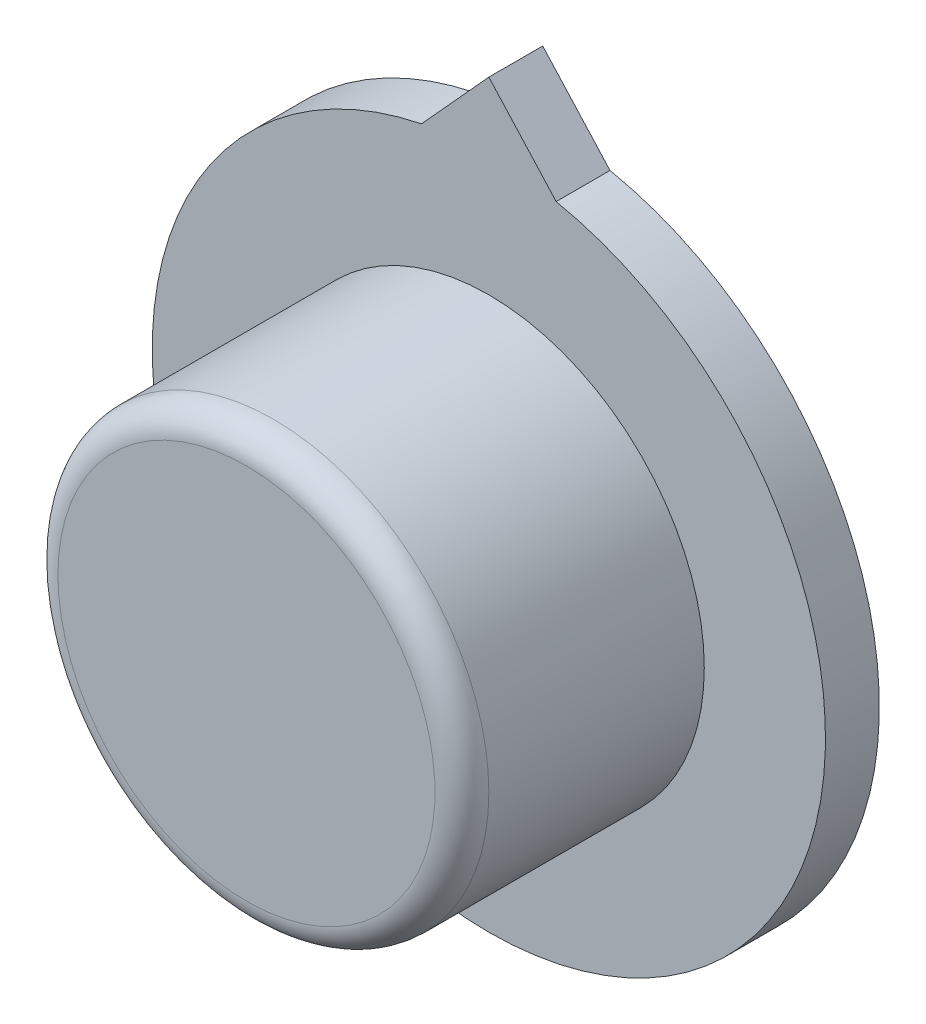
ISO-10303-21;
HEADER;
FILE_DESCRIPTION(('STEP AP214'),'2;1');
FILE_NAME('part.step','',(''),(''),'','','');
FILE_SCHEMA(('AUTOMOTIVE_DESIGN { 1 0 10303 214 1 1 1 1 }'));
ENDSEC;
DATA;
#1=APPLICATION_CONTEXT('core data for automotive mechanical design processes');
#2=APPLICATION_PROTOCOL_DEFINITION('international standard','automotive_design',2000,#1);
#3=PRODUCT_CONTEXT('',#1,'mechanical');
#4=PRODUCT('Part','Part','',(#3));
#5=PRODUCT_RELATED_PRODUCT_CATEGORY('part','',(#4));
#6=PRODUCT_DEFINITION_FORMATION('','',#4);
#7=PRODUCT_DEFINITION_CONTEXT('part definition',#1,'design');
#8=PRODUCT_DEFINITION('design','',#6,#7);
#9=PRODUCT_DEFINITION_SHAPE('','',#8);
#10=(LENGTH_UNIT() NAMED_UNIT(*) SI_UNIT(.MILLI.,.METRE.));
#11=(NAMED_UNIT(*) PLANE_ANGLE_UNIT() SI_UNIT($,.RADIAN.));
#12=(NAMED_UNIT(*) SI_UNIT($,.STERADIAN.) SOLID_ANGLE_UNIT());
#13=UNCERTAINTY_MEASURE_WITH_UNIT(LENGTH_MEASURE(1.E-05),#10,'distance_accuracy_value','');
#14=(GEOMETRIC_REPRESENTATION_CONTEXT(3) GLOBAL_UNCERTAINTY_ASSIGNED_CONTEXT((#13)) GLOBAL_UNIT_ASSIGNED_CONTEXT((#10,
#11,#12)) REPRESENTATION_CONTEXT('',''));
#15=CARTESIAN_POINT('',(0.,0.,0.));
#16=DIRECTION('',(0.,0.,1.));
#17=DIRECTION('',(1.,0.,0.));
#18=AXIS2_PLACEMENT_3D('',#15,#16,#17);
#19=CARTESIAN_POINT('',(0.,0.,-3.97770916903478));
#20=DIRECTION('',(0.,0.,-1.));
#21=DIRECTION('',(-1.,0.,0.));
#22=AXIS2_PLACEMENT_3D('',#19,#20,#21);
#23=PLANE('',#22);
#24=CARTESIAN_POINT('',(0.,0.,-3.97770916903478));
#25=DIRECTION('',(0.,0.,-1.));
#26=DIRECTION('',(-1.,0.,0.));
#27=AXIS2_PLACEMENT_3D('',#24,#25,#26);
#28=CIRCLE('',#27,2.);
#29=CARTESIAN_POINT('',(-2.,0.,-3.97770916903478));
#30=VERTEX_POINT('',#29);
#31=EDGE_CURVE('E21',#30,#30,#28,.F.);
#32=ORIENTED_EDGE('',*,*,#31,.F.);
#33=EDGE_LOOP('',(#32));
#34=FACE_BOUND('',#33,.T.);
#35=ADVANCED_FACE('F17',(#34),#23,.T.);
#36=CARTESIAN_POINT('',(0.,7.,0.));
#37=DIRECTION('',(0.,0.,1.));
#38=DIRECTION('',(1.,0.,0.));
#39=AXIS2_PLACEMENT_3D('',#36,#37,#38);
#40=PLANE('',#39);
#41=CARTESIAN_POINT('',(0.,0.,0.));
#42=DIRECTION('',(0.,0.,-1.));
#43=DIRECTION('',(-1.,0.,0.));
#44=AXIS2_PLACEMENT_3D('',#41,#42,#43);
#45=CIRCLE('',#44,7.);
#46=CARTESIAN_POINT('',(-7.,0.,0.));
#47=VERTEX_POINT('',#46);
#48=EDGE_CURVE('E88',#47,#47,#45,.T.);
#49=ORIENTED_EDGE('',*,*,#48,.F.);
#50=EDGE_LOOP('',(#49));
#51=FACE_BOUND('',#50,.T.);
#52=ADVANCED_FACE('F107',(#51),#40,.T.);
#53=CARTESIAN_POINT('',(0.,0.,-2.98885458451739));
#54=DIRECTION('',(0.,0.,-1.));
#55=DIRECTION('',(-1.,0.,0.));
#56=AXIS2_PLACEMENT_3D('',#53,#54,#55);
#57=CYLINDRICAL_SURFACE('',#56,2.);
#58=ORIENTED_EDGE('',*,*,#31,.T.);
#59=EDGE_LOOP('',(#58));
#60=FACE_BOUND('',#59,.T.);
#61=CARTESIAN_POINT('',(0.,0.,-2.));
#62=DIRECTION('',(0.,0.,-1.));
#63=DIRECTION('',(-1.,0.,0.));
#64=AXIS2_PLACEMENT_3D('',#61,#62,#63);
#65=CIRCLE('',#64,2.);
#66=CARTESIAN_POINT('',(-2.,0.,-2.));
#67=VERTEX_POINT('',#66);
#68=EDGE_CURVE('E87',#67,#67,#65,.F.);
#69=ORIENTED_EDGE('',*,*,#68,.F.);
#70=EDGE_LOOP('',(#69));
#71=FACE_BOUND('',#70,.T.);
#72=ADVANCED_FACE('F104',(#60,#71),#57,.T.);
#73=CARTESIAN_POINT('',(0.,0.,-1.));
#74=DIRECTION('',(0.,0.,-1.));
#75=DIRECTION('',(-1.,0.,0.));
#76=AXIS2_PLACEMENT_3D('',#73,#74,#75);
#77=TOROIDAL_SURFACE('',#76,7.,1.);
#78=CARTESIAN_POINT('',(0.,0.,-1.));
#79=DIRECTION('',(0.,0.,-1.));
#80=DIRECTION('',(-1.,0.,0.));
#81=AXIS2_PLACEMENT_3D('',#78,#79,#80);
#82=CIRCLE('',#81,8.);
#83=CARTESIAN_POINT('',(-8.,0.,-1.));
#84=VERTEX_POINT('',#83);
#85=EDGE_CURVE('E83',#84,#84,#82,.T.);
#86=ORIENTED_EDGE('',*,*,#85,.F.);
#87=EDGE_LOOP('',(#86));
#88=FACE_BOUND('',#87,.T.);
#89=ORIENTED_EDGE('',*,*,#48,.T.);
#90=EDGE_LOOP('',(#89));
#91=FACE_BOUND('',#90,.T.);
#92=ADVANCED_FACE('F106',(#88,#91),#77,.T.);
#93=CARTESIAN_POINT('',(0.,2.,-2.));
#94=DIRECTION('',(0.,0.,-1.));
#95=DIRECTION('',(-1.,0.,0.));
#96=AXIS2_PLACEMENT_3D('',#93,#94,#95);
#97=PLANE('',#96);
#98=CARTESIAN_POINT('',(0.,0.,-2.));
#99=DIRECTION('',(0.,0.,-1.));
#100=DIRECTION('',(-1.,0.,0.));
#101=AXIS2_PLACEMENT_3D('',#98,#99,#100);
#102=CIRCLE('',#101,5.5);
#103=CARTESIAN_POINT('',(-5.5,0.,-2.));
#104=VERTEX_POINT('',#103);
#105=EDGE_CURVE('E86',#104,#104,#102,.T.);
#106=ORIENTED_EDGE('',*,*,#105,.T.);
#107=EDGE_LOOP('',(#106));
#108=FACE_BOUND('',#107,.T.);
#109=ORIENTED_EDGE('',*,*,#68,.T.);
#110=EDGE_LOOP('',(#109));
#111=FACE_BOUND('',#110,.T.);
#112=ADVANCED_FACE('F102',(#108,#111),#97,.T.);
#113=CARTESIAN_POINT('',(0.,0.,-5.));
#114=DIRECTION('',(0.,0.,-1.));
#115=DIRECTION('',(-1.,0.,0.));
#116=AXIS2_PLACEMENT_3D('',#113,#114,#115);
#117=CYLINDRICAL_SURFACE('',#116,8.);
#118=CARTESIAN_POINT('',(0.,0.,-9.));
#119=DIRECTION('',(0.,0.,-1.));
#120=DIRECTION('',(-1.,0.,0.));
#121=AXIS2_PLACEMENT_3D('',#118,#119,#120);
#122=CIRCLE('',#121,8.);
#123=CARTESIAN_POINT('',(-8.,0.,-9.));
#124=VERTEX_POINT('',#123);
#125=EDGE_CURVE('E82',#124,#124,#122,.T.);
#126=ORIENTED_EDGE('',*,*,#125,.F.);
#127=EDGE_LOOP('',(#126));
#128=FACE_BOUND('',#127,.T.);
#129=ORIENTED_EDGE('',*,*,#85,.T.);
#130=EDGE_LOOP('',(#129));
#131=FACE_BOUND('',#130,.T.);
#132=ADVANCED_FACE('F142',(#128,#131),#117,.T.);
#133=CARTESIAN_POINT('',(0.,0.,-2.5));
#134=DIRECTION('',(0.,0.,-1.));
#135=DIRECTION('',(-1.,0.,0.));
#136=AXIS2_PLACEMENT_3D('',#133,#134,#135);
#137=TOROIDAL_SURFACE('',#136,5.5,0.500000000000001);
#138=ORIENTED_EDGE('',*,*,#105,.F.);
#139=EDGE_LOOP('',(#138));
#140=FACE_BOUND('',#139,.T.);
#141=CARTESIAN_POINT('',(0.,0.,-2.5));
#142=DIRECTION('',(0.,0.,-1.));
#143=DIRECTION('',(-1.,0.,0.));
#144=AXIS2_PLACEMENT_3D('',#141,#142,#143);
#145=CIRCLE('',#144,6.);
#146=CARTESIAN_POINT('',(-6.,0.,-2.5));
#147=VERTEX_POINT('',#146);
#148=EDGE_CURVE('E65',#147,#147,#145,.T.);
#149=ORIENTED_EDGE('',*,*,#148,.T.);
#150=EDGE_LOOP('',(#149));
#151=FACE_BOUND('',#150,.T.);
#152=ADVANCED_FACE('F19',(#140,#151),#137,.F.);
#153=CARTESIAN_POINT('',(0.,12.5,-9.));
#154=DIRECTION('',(0.,0.,1.));
#155=DIRECTION('',(1.,0.,0.));
#156=AXIS2_PLACEMENT_3D('',#153,#154,#155);
#157=PLANE('',#156);
#158=CARTESIAN_POINT('',(0.,0.,-9.));
#159=DIRECTION('',(0.,0.,-1.));
#160=DIRECTION('',(-1.,0.,0.));
#161=AXIS2_PLACEMENT_3D('',#158,#159,#160);
#162=CIRCLE('',#161,12.5);
#163=CARTESIAN_POINT('',(2.50000000000001,12.2474487139159,-9.));
#164=VERTEX_POINT('',#163);
#165=CARTESIAN_POINT('',(-2.5,12.2474487139159,-9.));
#166=VERTEX_POINT('',#165);
#167=EDGE_CURVE('E53',#164,#166,#162,.T.);
#168=ORIENTED_EDGE('',*,*,#167,.F.);
#169=DIRECTION('',(-0.672331212813863,0.740250457802115,0.));
#170=VECTOR('',#169,1.);
#171=CARTESIAN_POINT('',(2.5,12.2474487139159,-9.));
#172=LINE('',#171,#170);
#173=CARTESIAN_POINT('',(0.,15.,-9.));
#174=VERTEX_POINT('',#173);
#175=EDGE_CURVE('E54',#174,#164,#172,.F.);
#176=ORIENTED_EDGE('',*,*,#175,.F.);
#177=DIRECTION('',(-0.672331212813863,-0.740250457802115,0.));
#178=VECTOR('',#177,1.);
#179=CARTESIAN_POINT('',(0.,15.,-9.));
#180=LINE('',#179,#178);
#181=EDGE_CURVE('E49',#166,#174,#180,.F.);
#182=ORIENTED_EDGE('',*,*,#181,.F.);
#183=EDGE_LOOP('',(#168,#176,#182));
#184=FACE_BOUND('',#183,.T.);
#185=ORIENTED_EDGE('',*,*,#125,.T.);
#186=EDGE_LOOP('',(#185));
#187=FACE_BOUND('',#186,.T.);
#188=ADVANCED_FACE('F55',(#184,#187),#157,.T.);
#189=CARTESIAN_POINT('',(0.,0.,-6.75));
#190=DIRECTION('',(0.,0.,-1.));
#191=DIRECTION('',(-1.,0.,0.));
#192=AXIS2_PLACEMENT_3D('',#189,#190,#191);
#193=CYLINDRICAL_SURFACE('',#192,6.);
#194=ORIENTED_EDGE('',*,*,#148,.F.);
#195=EDGE_LOOP('',(#194));
#196=FACE_BOUND('',#195,.T.);
#197=CARTESIAN_POINT('',(0.,0.,-11.));
#198=DIRECTION('',(0.,0.,-1.));
#199=DIRECTION('',(-1.,0.,0.));
#200=AXIS2_PLACEMENT_3D('',#197,#198,#199);
#201=CIRCLE('',#200,6.);
#202=CARTESIAN_POINT('',(-6.,0.,-11.));
#203=VERTEX_POINT('',#202);
#204=EDGE_CURVE('E91',#203,#203,#201,.F.);
#205=ORIENTED_EDGE('',*,*,#204,.F.);
#206=EDGE_LOOP('',(#205));
#207=FACE_BOUND('',#206,.T.);
#208=ADVANCED_FACE('F136',(#196,#207),#193,.F.);
#209=CARTESIAN_POINT('',(0.,15.,-11.));
#210=DIRECTION('',(-0.740250457802115,0.672331212813863,0.));
#211=DIRECTION('',(-0.672331212813863,-0.740250457802115,0.));
#212=AXIS2_PLACEMENT_3D('',#209,#210,#211);
#213=PLANE('',#212);
#214=DIRECTION('',(0.672331212813863,0.740250457802114,0.));
#215=VECTOR('',#214,1.);
#216=CARTESIAN_POINT('',(-2.5,12.2474487139159,-11.));
#217=LINE('',#216,#215);
#218=CARTESIAN_POINT('',(-2.5,12.2474487139159,-11.));
#219=VERTEX_POINT('',#218);
#220=CARTESIAN_POINT('',(0.,15.,-11.));
#221=VERTEX_POINT('',#220);
#222=EDGE_CURVE('E94',#219,#221,#217,.T.);
#223=ORIENTED_EDGE('',*,*,#222,.F.);
#224=DIRECTION('',(0.,0.,-1.));
#225=VECTOR('',#224,1.);
#226=CARTESIAN_POINT('',(-2.5,12.2474487139159,-10.));
#227=LINE('',#226,#225);
#228=EDGE_CURVE('E64',#166,#219,#227,.T.);
#229=ORIENTED_EDGE('',*,*,#228,.F.);
#230=ORIENTED_EDGE('',*,*,#181,.T.);
#231=DIRECTION('',(0.,0.,1.));
#232=VECTOR('',#231,1.);
#233=CARTESIAN_POINT('',(0.,15.,-11.));
#234=LINE('',#233,#232);
#235=EDGE_CURVE('E58',#221,#174,#234,.T.);
#236=ORIENTED_EDGE('',*,*,#235,.F.);
#237=EDGE_LOOP('',(#223,#229,#230,#236));
#238=FACE_BOUND('',#237,.T.);
#239=ADVANCED_FACE('F62',(#238),#213,.T.);
#240=CARTESIAN_POINT('',(2.5,12.2474487139159,-11.));
#241=DIRECTION('',(0.740250457802115,0.672331212813863,0.));
#242=DIRECTION('',(-0.672331212813863,0.740250457802115,0.));
#243=AXIS2_PLACEMENT_3D('',#240,#241,#242);
#244=PLANE('',#243);
#245=DIRECTION('',(0.672331212813864,-0.740250457802114,0.));
#246=VECTOR('',#245,1.);
#247=CARTESIAN_POINT('',(0.,15.,-11.));
#248=LINE('',#247,#246);
#249=CARTESIAN_POINT('',(2.50000000000001,12.2474487139159,-11.));
#250=VERTEX_POINT('',#249);
#251=EDGE_CURVE('E27',#221,#250,#248,.T.);
#252=ORIENTED_EDGE('',*,*,#251,.F.);
#253=ORIENTED_EDGE('',*,*,#235,.T.);
#254=ORIENTED_EDGE('',*,*,#175,.T.);
#255=DIRECTION('',(0.,0.,-1.));
#256=VECTOR('',#255,1.);
#257=CARTESIAN_POINT('',(2.5,12.2474487139159,-10.));
#258=LINE('',#257,#256);
#259=EDGE_CURVE('E36',#250,#164,#258,.F.);
#260=ORIENTED_EDGE('',*,*,#259,.F.);
#261=EDGE_LOOP('',(#252,#253,#254,#260));
#262=FACE_BOUND('',#261,.T.);
#263=ADVANCED_FACE('F67',(#262),#244,.T.);
#264=CARTESIAN_POINT('',(0.,0.,-10.));
#265=DIRECTION('',(0.,0.,-1.));
#266=DIRECTION('',(-1.,0.,0.));
#267=AXIS2_PLACEMENT_3D('',#264,#265,#266);
#268=CYLINDRICAL_SURFACE('',#267,12.5);
#269=ORIENTED_EDGE('',*,*,#228,.T.);
#270=CARTESIAN_POINT('',(0.,0.,-11.));
#271=DIRECTION('',(0.,0.,-1.));
#272=DIRECTION('',(-1.,0.,0.));
#273=AXIS2_PLACEMENT_3D('',#270,#271,#272);
#274=CIRCLE('',#273,12.5);
#275=EDGE_CURVE('E11',#250,#219,#274,.T.);
#276=ORIENTED_EDGE('',*,*,#275,.F.);
#277=ORIENTED_EDGE('',*,*,#259,.T.);
#278=ORIENTED_EDGE('',*,*,#167,.T.);
#279=EDGE_LOOP('',(#269,#276,#277,#278));
#280=FACE_BOUND('',#279,.T.);
#281=ADVANCED_FACE('F122',(#280),#268,.T.);
#282=CARTESIAN_POINT('',(0.,6.,-11.));
#283=DIRECTION('',(0.,0.,-1.));
#284=DIRECTION('',(-1.,0.,0.));
#285=AXIS2_PLACEMENT_3D('',#282,#283,#284);
#286=PLANE('',#285);
#287=ORIENTED_EDGE('',*,*,#275,.T.);
#288=ORIENTED_EDGE('',*,*,#222,.T.);
#289=ORIENTED_EDGE('',*,*,#251,.T.);
#290=EDGE_LOOP('',(#287,#288,#289));
#291=FACE_BOUND('',#290,.T.);
#292=ORIENTED_EDGE('',*,*,#204,.T.);
#293=EDGE_LOOP('',(#292));
#294=FACE_BOUND('',#293,.T.);
#295=ADVANCED_FACE('F120',(#291,#294),#286,.T.);
#296=CLOSED_SHELL('',(#35,#52,#72,#92,#112,#132,#152,#188,#208,#239,#263,#281,#295));
#297=MANIFOLD_SOLID_BREP('B1',#296);
#298=ADVANCED_BREP_SHAPE_REPRESENTATION('',(#18,#297),#14);
#299=SHAPE_DEFINITION_REPRESENTATION(#9,#298);
ENDSEC;
END-ISO-10303-21;
